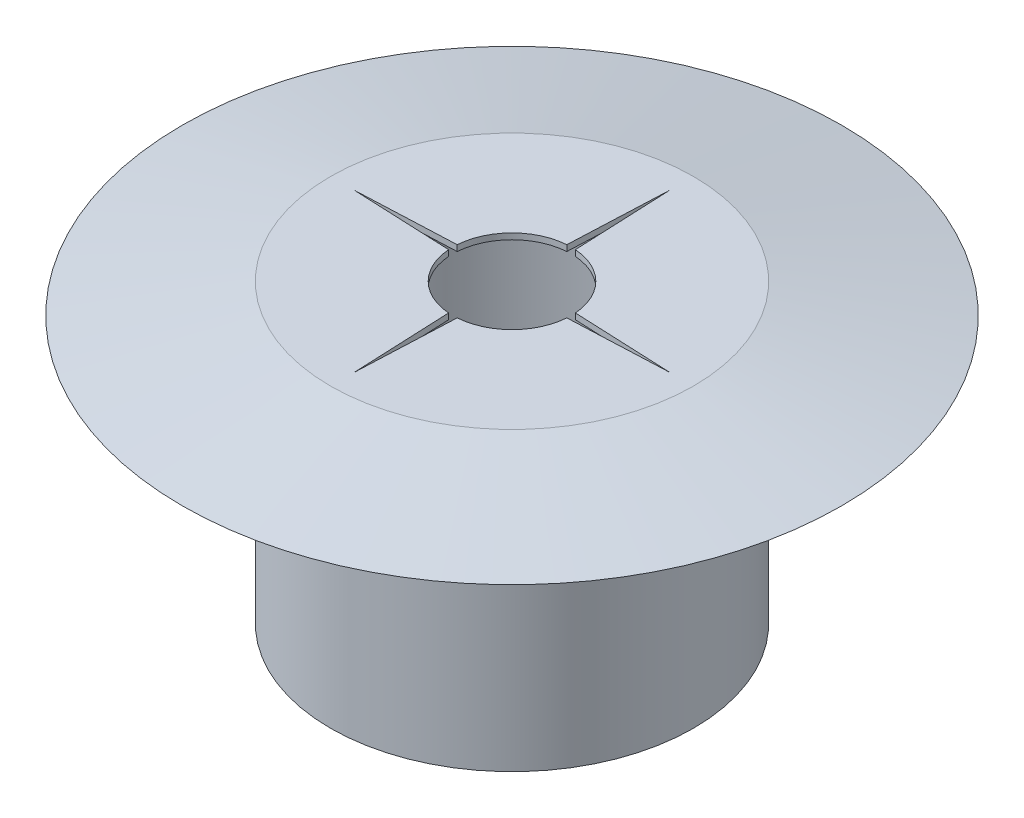
ISO-10303-21;
HEADER;
FILE_DESCRIPTION(('STEP AP214'),'2;1');
FILE_NAME('part.step','',(''),(''),'','','');
FILE_SCHEMA(('AUTOMOTIVE_DESIGN { 1 0 10303 214 1 1 1 1 }'));
ENDSEC;
DATA;
#1=APPLICATION_CONTEXT('core data for automotive mechanical design processes');
#2=APPLICATION_PROTOCOL_DEFINITION('international standard','automotive_design',2000,#1);
#3=PRODUCT_CONTEXT('',#1,'mechanical');
#4=PRODUCT('Part','Part','',(#3));
#5=PRODUCT_RELATED_PRODUCT_CATEGORY('part','',(#4));
#6=PRODUCT_DEFINITION_FORMATION('','',#4);
#7=PRODUCT_DEFINITION_CONTEXT('part definition',#1,'design');
#8=PRODUCT_DEFINITION('design','',#6,#7);
#9=PRODUCT_DEFINITION_SHAPE('','',#8);
#10=(LENGTH_UNIT() NAMED_UNIT(*) SI_UNIT(.MILLI.,.METRE.));
#11=(NAMED_UNIT(*) PLANE_ANGLE_UNIT() SI_UNIT($,.RADIAN.));
#12=(NAMED_UNIT(*) SI_UNIT($,.STERADIAN.) SOLID_ANGLE_UNIT());
#13=UNCERTAINTY_MEASURE_WITH_UNIT(LENGTH_MEASURE(1.E-05),#10,'distance_accuracy_value','');
#14=(GEOMETRIC_REPRESENTATION_CONTEXT(3) GLOBAL_UNCERTAINTY_ASSIGNED_CONTEXT((#13)) GLOBAL_UNIT_ASSIGNED_CONTEXT((#10,
#11,#12)) REPRESENTATION_CONTEXT('',''));
#15=CARTESIAN_POINT('',(0.,0.,0.));
#16=DIRECTION('',(0.,0.,1.));
#17=DIRECTION('',(1.,0.,0.));
#18=AXIS2_PLACEMENT_3D('',#15,#16,#17);
#19=CARTESIAN_POINT('',(0.,0.,0.));
#20=DIRECTION('',(0.,-1.,0.));
#21=DIRECTION('',(0.,0.,-1.));
#22=AXIS2_PLACEMENT_3D('',#19,#20,#21);
#23=CYLINDRICAL_SURFACE('',#22,10.9);
#24=CARTESIAN_POINT('',(0.,0.,0.));
#25=DIRECTION('',(0.,-1.,0.));
#26=DIRECTION('',(0.,0.,-1.));
#27=AXIS2_PLACEMENT_3D('',#24,#25,#26);
#28=CIRCLE('',#27,10.9);
#29=CARTESIAN_POINT('',(0.,0.,-10.9));
#30=VERTEX_POINT('',#29);
#31=EDGE_CURVE('E44',#30,#30,#28,.T.);
#32=ORIENTED_EDGE('',*,*,#31,.T.);
#33=EDGE_LOOP('',(#32));
#34=FACE_BOUND('',#33,.T.);
#35=CARTESIAN_POINT('',(0.,19.6,0.));
#36=DIRECTION('',(0.,1.,0.));
#37=DIRECTION('',(0.,0.,1.));
#38=AXIS2_PLACEMENT_3D('',#35,#36,#37);
#39=CIRCLE('',#38,10.9);
#40=CARTESIAN_POINT('',(0.,19.6,10.9));
#41=VERTEX_POINT('',#40);
#42=EDGE_CURVE('E11',#41,#41,#39,.F.);
#43=ORIENTED_EDGE('',*,*,#42,.F.);
#44=EDGE_LOOP('',(#43));
#45=FACE_BOUND('',#44,.T.);
#46=ADVANCED_FACE('F35',(#34,#45),#23,.F.);
#47=CARTESIAN_POINT('',(-12.25,20.,0.));
#48=DIRECTION('',(0.,-1.,0.));
#49=DIRECTION('',(0.,0.,-1.));
#50=AXIS2_PLACEMENT_3D('',#47,#48,#49);
#51=PLANE('',#50);
#52=CARTESIAN_POINT('',(0.,20.,0.));
#53=DIRECTION('',(0.,-1.,0.));
#54=DIRECTION('',(0.,0.,-1.));
#55=AXIS2_PLACEMENT_3D('',#52,#53,#54);
#56=CIRCLE('',#55,12.25);
#57=CARTESIAN_POINT('',(0.,20.,-12.25));
#58=VERTEX_POINT('',#57);
#59=EDGE_CURVE('E190',#58,#58,#56,.T.);
#60=ORIENTED_EDGE('',*,*,#59,.F.);
#61=EDGE_LOOP('',(#60));
#62=FACE_BOUND('',#61,.T.);
#63=DIRECTION('',(-0.0435759641745513,0.,-0.999050116533829));
#64=VECTOR('',#63,1.);
#65=CARTESIAN_POINT('',(0.463199901978154,20.,-0.0202035733745618));
#66=LINE('',#65,#64);
#67=CARTESIAN_POINT('',(0.290070903590342,20.,-3.98946849478603));
#68=VERTEX_POINT('',#67);
#69=CARTESIAN_POINT('',(0.,20.,-10.6398175008156));
#70=VERTEX_POINT('',#69);
#71=EDGE_CURVE('E157',#68,#70,#66,.T.);
#72=ORIENTED_EDGE('',*,*,#71,.F.);
#73=CARTESIAN_POINT('',(0.,20.,0.));
#74=DIRECTION('',(0.,1.,0.));
#75=DIRECTION('',(0.,0.,1.));
#76=AXIS2_PLACEMENT_3D('',#73,#74,#75);
#77=CIRCLE('',#76,4.);
#78=CARTESIAN_POINT('',(3.98946849478603,20.,-0.290070903590343));
#79=VERTEX_POINT('',#78);
#80=EDGE_CURVE('E159',#68,#79,#77,.F.);
#81=ORIENTED_EDGE('',*,*,#80,.T.);
#82=DIRECTION('',(0.999050116533829,0.,0.0435759641745516));
#83=VECTOR('',#82,1.);
#84=CARTESIAN_POINT('',(0.020203573374562,20.,-0.463199901978156));
#85=LINE('',#84,#83);
#86=CARTESIAN_POINT('',(10.6398175008156,20.,0.));
#87=VERTEX_POINT('',#86);
#88=EDGE_CURVE('E162',#79,#87,#85,.T.);
#89=ORIENTED_EDGE('',*,*,#88,.T.);
#90=DIRECTION('',(0.99905011653383,0.,-0.0435759641745505));
#91=VECTOR('',#90,1.);
#92=CARTESIAN_POINT('',(0.0202035733745613,20.,0.463199901978152));
#93=LINE('',#92,#91);
#94=CARTESIAN_POINT('',(3.98946849478603,20.,0.290070903590343));
#95=VERTEX_POINT('',#94);
#96=EDGE_CURVE('E165',#95,#87,#93,.T.);
#97=ORIENTED_EDGE('',*,*,#96,.F.);
#98=CARTESIAN_POINT('',(0.,20.,0.));
#99=DIRECTION('',(0.,1.,0.));
#100=DIRECTION('',(0.,0.,1.));
#101=AXIS2_PLACEMENT_3D('',#98,#99,#100);
#102=CIRCLE('',#101,4.00000000000002);
#103=CARTESIAN_POINT('',(0.290070903590342,20.,3.98946849478603));
#104=VERTEX_POINT('',#103);
#105=EDGE_CURVE('E168',#95,#104,#102,.F.);
#106=ORIENTED_EDGE('',*,*,#105,.T.);
#107=DIRECTION('',(-0.0435759641745507,0.,0.999050116533829));
#108=VECTOR('',#107,1.);
#109=CARTESIAN_POINT('',(0.463199901978152,20.,0.0202035733745614));
#110=LINE('',#109,#108);
#111=CARTESIAN_POINT('',(0.,20.,10.6398175008156));
#112=VERTEX_POINT('',#111);
#113=EDGE_CURVE('E171',#104,#112,#110,.T.);
#114=ORIENTED_EDGE('',*,*,#113,.T.);
#115=DIRECTION('',(0.0435759641745512,0.,0.999050116533829));
#116=VECTOR('',#115,1.);
#117=CARTESIAN_POINT('',(-0.463199901978154,20.,0.0202035733745617));
#118=LINE('',#117,#116);
#119=CARTESIAN_POINT('',(-0.290070903590342,20.,3.98946849478603));
#120=VERTEX_POINT('',#119);
#121=EDGE_CURVE('E174',#120,#112,#118,.T.);
#122=ORIENTED_EDGE('',*,*,#121,.F.);
#123=CARTESIAN_POINT('',(0.,20.,0.));
#124=DIRECTION('',(0.,1.,0.));
#125=DIRECTION('',(0.,0.,1.));
#126=AXIS2_PLACEMENT_3D('',#123,#124,#125);
#127=CIRCLE('',#126,4.);
#128=CARTESIAN_POINT('',(-3.98946849478603,20.,0.290070903590342));
#129=VERTEX_POINT('',#128);
#130=EDGE_CURVE('E177',#120,#129,#127,.F.);
#131=ORIENTED_EDGE('',*,*,#130,.T.);
#132=DIRECTION('',(-0.99905011653383,0.,-0.0435759641745507));
#133=VECTOR('',#132,1.);
#134=CARTESIAN_POINT('',(-0.0202035733745614,20.,0.463199901978152));
#135=LINE('',#134,#133);
#136=CARTESIAN_POINT('',(-10.6398175008156,20.,0.));
#137=VERTEX_POINT('',#136);
#138=EDGE_CURVE('E180',#129,#137,#135,.T.);
#139=ORIENTED_EDGE('',*,*,#138,.T.);
#140=DIRECTION('',(-0.999050116533829,0.,0.0435759641745513));
#141=VECTOR('',#140,1.);
#142=CARTESIAN_POINT('',(-0.0202035733745618,20.,-0.463199901978154));
#143=LINE('',#142,#141);
#144=CARTESIAN_POINT('',(-3.98946849478603,20.,-0.290070903590342));
#145=VERTEX_POINT('',#144);
#146=EDGE_CURVE('E183',#145,#137,#143,.T.);
#147=ORIENTED_EDGE('',*,*,#146,.F.);
#148=CARTESIAN_POINT('',(0.,20.,0.));
#149=DIRECTION('',(0.,1.,0.));
#150=DIRECTION('',(0.,0.,1.));
#151=AXIS2_PLACEMENT_3D('',#148,#149,#150);
#152=CIRCLE('',#151,3.99999999999997);
#153=CARTESIAN_POINT('',(-0.290070903590342,20.,-3.98946849478603));
#154=VERTEX_POINT('',#153);
#155=EDGE_CURVE('E138',#145,#154,#152,.F.);
#156=ORIENTED_EDGE('',*,*,#155,.T.);
#157=DIRECTION('',(0.0435759641745506,0.,-0.999050116533829));
#158=VECTOR('',#157,1.);
#159=CARTESIAN_POINT('',(-0.463199901978152,20.,-0.0202035733745613));
#160=LINE('',#159,#158);
#161=EDGE_CURVE('E186',#154,#70,#160,.T.);
#162=ORIENTED_EDGE('',*,*,#161,.T.);
#163=EDGE_LOOP('',(#72,#81,#89,#97,#106,#114,#122,#131,#139,#147,#156,#162));
#164=FACE_BOUND('',#163,.T.);
#165=ADVANCED_FACE('F37',(#62,#164),#51,.F.);
#166=CARTESIAN_POINT('',(-10.9,0.,0.));
#167=DIRECTION('',(0.,1.,0.));
#168=DIRECTION('',(0.,0.,1.));
#169=AXIS2_PLACEMENT_3D('',#166,#167,#168);
#170=PLANE('',#169);
#171=ORIENTED_EDGE('',*,*,#31,.F.);
#172=EDGE_LOOP('',(#171));
#173=FACE_BOUND('',#172,.T.);
#174=CARTESIAN_POINT('',(0.,0.,0.));
#175=DIRECTION('',(0.,-1.,0.));
#176=DIRECTION('',(0.,0.,-1.));
#177=AXIS2_PLACEMENT_3D('',#174,#175,#176);
#178=CIRCLE('',#177,12.25);
#179=CARTESIAN_POINT('',(0.,0.,-12.25));
#180=VERTEX_POINT('',#179);
#181=EDGE_CURVE('E216',#180,#180,#178,.T.);
#182=ORIENTED_EDGE('',*,*,#181,.T.);
#183=EDGE_LOOP('',(#182));
#184=FACE_BOUND('',#183,.T.);
#185=ADVANCED_FACE('F223',(#173,#184),#170,.F.);
#186=CARTESIAN_POINT('',(0.,0.,0.));
#187=DIRECTION('',(0.,-1.,0.));
#188=DIRECTION('',(0.,0.,-1.));
#189=AXIS2_PLACEMENT_3D('',#186,#187,#188);
#190=CYLINDRICAL_SURFACE('',#189,12.25);
#191=ORIENTED_EDGE('',*,*,#181,.F.);
#192=EDGE_LOOP('',(#191));
#193=FACE_BOUND('',#192,.T.);
#194=CARTESIAN_POINT('',(0.,18.,0.));
#195=DIRECTION('',(0.,-1.,0.));
#196=DIRECTION('',(0.,0.,-1.));
#197=AXIS2_PLACEMENT_3D('',#194,#195,#196);
#198=CIRCLE('',#197,12.25);
#199=CARTESIAN_POINT('',(0.,18.,-12.25));
#200=VERTEX_POINT('',#199);
#201=EDGE_CURVE('E213',#200,#200,#198,.T.);
#202=ORIENTED_EDGE('',*,*,#201,.T.);
#203=EDGE_LOOP('',(#202));
#204=FACE_BOUND('',#203,.T.);
#205=ADVANCED_FACE('F226',(#193,#204),#190,.T.);
#206=CARTESIAN_POINT('',(-12.25,18.,0.));
#207=DIRECTION('',(0.,1.,0.));
#208=DIRECTION('',(0.,0.,1.));
#209=AXIS2_PLACEMENT_3D('',#206,#207,#208);
#210=PLANE('',#209);
#211=ORIENTED_EDGE('',*,*,#201,.F.);
#212=EDGE_LOOP('',(#211));
#213=FACE_BOUND('',#212,.T.);
#214=CARTESIAN_POINT('',(0.,18.,0.));
#215=DIRECTION('',(0.,-1.,0.));
#216=DIRECTION('',(0.,0.,-1.));
#217=AXIS2_PLACEMENT_3D('',#214,#215,#216);
#218=CIRCLE('',#217,22.25);
#219=CARTESIAN_POINT('',(0.,18.,-22.25));
#220=VERTEX_POINT('',#219);
#221=EDGE_CURVE('E210',#220,#220,#218,.T.);
#222=ORIENTED_EDGE('',*,*,#221,.T.);
#223=EDGE_LOOP('',(#222));
#224=FACE_BOUND('',#223,.T.);
#225=ADVANCED_FACE('F232',(#213,#224),#210,.F.);
#226=CARTESIAN_POINT('',(0.,20.,0.));
#227=DIRECTION('',(0.,-1.,0.));
#228=DIRECTION('',(0.,0.,-1.));
#229=AXIS2_PLACEMENT_3D('',#226,#227,#228);
#230=CONICAL_SURFACE('',#229,12.25,1.37340076694502);
#231=ORIENTED_EDGE('',*,*,#221,.F.);
#232=EDGE_LOOP('',(#231));
#233=FACE_BOUND('',#232,.T.);
#234=ORIENTED_EDGE('',*,*,#59,.T.);
#235=EDGE_LOOP('',(#234));
#236=FACE_BOUND('',#235,.T.);
#237=ADVANCED_FACE('F238',(#233,#236),#230,.T.);
#238=CARTESIAN_POINT('',(0.463199901978154,19.6,-0.0202035733745618));
#239=DIRECTION('',(0.99905011653383,0.,-0.0435759641745513));
#240=DIRECTION('',(-0.0435759641745513,0.,-0.99905011653383));
#241=AXIS2_PLACEMENT_3D('',#238,#239,#240);
#242=PLANE('',#241);
#243=ORIENTED_EDGE('',*,*,#71,.T.);
#244=DIRECTION('',(0.,1.,0.));
#245=VECTOR('',#244,1.);
#246=CARTESIAN_POINT('',(0.,19.6,-10.6398175008156));
#247=LINE('',#246,#245);
#248=CARTESIAN_POINT('',(0.,19.6,-10.6398175008156));
#249=VERTEX_POINT('',#248);
#250=EDGE_CURVE('E100',#249,#70,#247,.T.);
#251=ORIENTED_EDGE('',*,*,#250,.F.);
#252=DIRECTION('',(-0.0435759641745513,0.,-0.999050116533829));
#253=VECTOR('',#252,1.);
#254=CARTESIAN_POINT('',(0.463199901978154,19.6,-0.0202035733745618));
#255=LINE('',#254,#253);
#256=CARTESIAN_POINT('',(0.290070903590342,19.6,-3.98946849478603));
#257=VERTEX_POINT('',#256);
#258=EDGE_CURVE('E52',#257,#249,#255,.T.);
#259=ORIENTED_EDGE('',*,*,#258,.F.);
#260=DIRECTION('',(0.,1.,0.));
#261=VECTOR('',#260,1.);
#262=CARTESIAN_POINT('',(0.290070903590342,19.6,-3.98946849478603));
#263=LINE('',#262,#261);
#264=EDGE_CURVE('E108',#257,#68,#263,.T.);
#265=ORIENTED_EDGE('',*,*,#264,.T.);
#266=EDGE_LOOP('',(#243,#251,#259,#265));
#267=FACE_BOUND('',#266,.T.);
#268=ADVANCED_FACE('F244',(#267),#242,.F.);
#269=CARTESIAN_POINT('',(-0.463199901978152,19.6,-0.0202035733745613));
#270=DIRECTION('',(0.99905011653383,0.,0.0435759641745506));
#271=DIRECTION('',(0.0435759641745506,0.,-0.99905011653383));
#272=AXIS2_PLACEMENT_3D('',#269,#270,#271);
#273=PLANE('',#272);
#274=ORIENTED_EDGE('',*,*,#161,.F.);
#275=DIRECTION('',(0.,1.,0.));
#276=VECTOR('',#275,1.);
#277=CARTESIAN_POINT('',(-0.290070903590342,19.6,-3.98946849478603));
#278=LINE('',#277,#276);
#279=CARTESIAN_POINT('',(-0.290070903590342,19.6,-3.98946849478603));
#280=VERTEX_POINT('',#279);
#281=EDGE_CURVE('E93',#280,#154,#278,.T.);
#282=ORIENTED_EDGE('',*,*,#281,.F.);
#283=DIRECTION('',(0.0435759641745506,0.,-0.999050116533829));
#284=VECTOR('',#283,1.);
#285=CARTESIAN_POINT('',(-0.463199901978152,19.6,-0.0202035733745613));
#286=LINE('',#285,#284);
#287=EDGE_CURVE('E152',#280,#249,#286,.T.);
#288=ORIENTED_EDGE('',*,*,#287,.T.);
#289=ORIENTED_EDGE('',*,*,#250,.T.);
#290=EDGE_LOOP('',(#274,#282,#288,#289));
#291=FACE_BOUND('',#290,.T.);
#292=ADVANCED_FACE('F287',(#291),#273,.T.);
#293=CARTESIAN_POINT('',(0.,19.6,0.));
#294=DIRECTION('',(0.,1.,0.));
#295=DIRECTION('',(0.,0.,1.));
#296=AXIS2_PLACEMENT_3D('',#293,#294,#295);
#297=CYLINDRICAL_SURFACE('',#296,3.99999999999997);
#298=ORIENTED_EDGE('',*,*,#155,.F.);
#299=DIRECTION('',(0.,1.,0.));
#300=VECTOR('',#299,1.);
#301=CARTESIAN_POINT('',(-3.98946849478603,19.6,-0.290070903590342));
#302=LINE('',#301,#300);
#303=CARTESIAN_POINT('',(-3.98946849478603,19.6,-0.290070903590342));
#304=VERTEX_POINT('',#303);
#305=EDGE_CURVE('E133',#304,#145,#302,.T.);
#306=ORIENTED_EDGE('',*,*,#305,.F.);
#307=CARTESIAN_POINT('',(0.,19.6,0.));
#308=DIRECTION('',(0.,1.,0.));
#309=DIRECTION('',(0.,0.,1.));
#310=AXIS2_PLACEMENT_3D('',#307,#308,#309);
#311=CIRCLE('',#310,3.99999999999997);
#312=EDGE_CURVE('E137',#304,#280,#311,.F.);
#313=ORIENTED_EDGE('',*,*,#312,.T.);
#314=ORIENTED_EDGE('',*,*,#281,.T.);
#315=EDGE_LOOP('',(#298,#306,#313,#314));
#316=FACE_BOUND('',#315,.T.);
#317=ADVANCED_FACE('F135',(#316),#297,.F.);
#318=CARTESIAN_POINT('',(-0.0202035733745618,19.6,-0.463199901978154));
#319=DIRECTION('',(-0.0435759641745513,0.,-0.99905011653383));
#320=DIRECTION('',(-0.99905011653383,0.,0.0435759641745513));
#321=AXIS2_PLACEMENT_3D('',#318,#319,#320);
#322=PLANE('',#321);
#323=ORIENTED_EDGE('',*,*,#146,.T.);
#324=DIRECTION('',(0.,1.,0.));
#325=VECTOR('',#324,1.);
#326=CARTESIAN_POINT('',(-10.6398175008156,19.6,0.));
#327=LINE('',#326,#325);
#328=CARTESIAN_POINT('',(-10.6398175008156,19.6,0.));
#329=VERTEX_POINT('',#328);
#330=EDGE_CURVE('E142',#329,#137,#327,.T.);
#331=ORIENTED_EDGE('',*,*,#330,.F.);
#332=DIRECTION('',(-0.999050116533829,0.,0.0435759641745513));
#333=VECTOR('',#332,1.);
#334=CARTESIAN_POINT('',(-0.0202035733745618,19.6,-0.463199901978154));
#335=LINE('',#334,#333);
#336=EDGE_CURVE('E145',#304,#329,#335,.T.);
#337=ORIENTED_EDGE('',*,*,#336,.F.);
#338=ORIENTED_EDGE('',*,*,#305,.T.);
#339=EDGE_LOOP('',(#323,#331,#337,#338));
#340=FACE_BOUND('',#339,.T.);
#341=ADVANCED_FACE('F146',(#340),#322,.F.);
#342=CARTESIAN_POINT('',(-0.0202035733745614,19.6,0.463199901978152));
#343=DIRECTION('',(0.0435759641745506,0.,-0.999050116533829));
#344=DIRECTION('',(-0.99905011653383,0.,-0.0435759641745507));
#345=AXIS2_PLACEMENT_3D('',#342,#343,#344);
#346=PLANE('',#345);
#347=ORIENTED_EDGE('',*,*,#138,.F.);
#348=DIRECTION('',(0.,1.,0.));
#349=VECTOR('',#348,1.);
#350=CARTESIAN_POINT('',(-3.98946849478603,19.6,0.290070903590342));
#351=LINE('',#350,#349);
#352=CARTESIAN_POINT('',(-3.98946849478603,19.6,0.290070903590342));
#353=VERTEX_POINT('',#352);
#354=EDGE_CURVE('E193',#353,#129,#351,.T.);
#355=ORIENTED_EDGE('',*,*,#354,.F.);
#356=DIRECTION('',(-0.99905011653383,0.,-0.0435759641745507));
#357=VECTOR('',#356,1.);
#358=CARTESIAN_POINT('',(-0.0202035733745614,19.6,0.463199901978152));
#359=LINE('',#358,#357);
#360=EDGE_CURVE('E149',#353,#329,#359,.T.);
#361=ORIENTED_EDGE('',*,*,#360,.T.);
#362=ORIENTED_EDGE('',*,*,#330,.T.);
#363=EDGE_LOOP('',(#347,#355,#361,#362));
#364=FACE_BOUND('',#363,.T.);
#365=ADVANCED_FACE('F286',(#364),#346,.T.);
#366=CARTESIAN_POINT('',(0.,19.6,0.));
#367=DIRECTION('',(0.,1.,0.));
#368=DIRECTION('',(0.,0.,1.));
#369=AXIS2_PLACEMENT_3D('',#366,#367,#368);
#370=CYLINDRICAL_SURFACE('',#369,4.);
#371=ORIENTED_EDGE('',*,*,#130,.F.);
#372=DIRECTION('',(0.,1.,0.));
#373=VECTOR('',#372,1.);
#374=CARTESIAN_POINT('',(-0.290070903590342,19.6,3.98946849478603));
#375=LINE('',#374,#373);
#376=CARTESIAN_POINT('',(-0.290070903590342,19.6,3.98946849478603));
#377=VERTEX_POINT('',#376);
#378=EDGE_CURVE('E195',#377,#120,#375,.T.);
#379=ORIENTED_EDGE('',*,*,#378,.F.);
#380=CARTESIAN_POINT('',(0.,19.6,0.));
#381=DIRECTION('',(0.,1.,0.));
#382=DIRECTION('',(0.,0.,1.));
#383=AXIS2_PLACEMENT_3D('',#380,#381,#382);
#384=CIRCLE('',#383,4.);
#385=EDGE_CURVE('E284',#377,#353,#384,.F.);
#386=ORIENTED_EDGE('',*,*,#385,.T.);
#387=ORIENTED_EDGE('',*,*,#354,.T.);
#388=EDGE_LOOP('',(#371,#379,#386,#387));
#389=FACE_BOUND('',#388,.T.);
#390=ADVANCED_FACE('F279',(#389),#370,.F.);
#391=CARTESIAN_POINT('',(-0.463199901978154,19.6,0.0202035733745617));
#392=DIRECTION('',(-0.99905011653383,0.,0.0435759641745512));
#393=DIRECTION('',(0.0435759641745512,0.,0.99905011653383));
#394=AXIS2_PLACEMENT_3D('',#391,#392,#393);
#395=PLANE('',#394);
#396=ORIENTED_EDGE('',*,*,#121,.T.);
#397=DIRECTION('',(0.,1.,0.));
#398=VECTOR('',#397,1.);
#399=CARTESIAN_POINT('',(0.,19.6,10.6398175008156));
#400=LINE('',#399,#398);
#401=CARTESIAN_POINT('',(0.,19.6,10.6398175008156));
#402=VERTEX_POINT('',#401);
#403=EDGE_CURVE('E197',#402,#112,#400,.T.);
#404=ORIENTED_EDGE('',*,*,#403,.F.);
#405=DIRECTION('',(0.0435759641745512,0.,0.999050116533829));
#406=VECTOR('',#405,1.);
#407=CARTESIAN_POINT('',(-0.463199901978154,19.6,0.0202035733745617));
#408=LINE('',#407,#406);
#409=EDGE_CURVE('E436',#377,#402,#408,.T.);
#410=ORIENTED_EDGE('',*,*,#409,.F.);
#411=ORIENTED_EDGE('',*,*,#378,.T.);
#412=EDGE_LOOP('',(#396,#404,#410,#411));
#413=FACE_BOUND('',#412,.T.);
#414=ADVANCED_FACE('F312',(#413),#395,.F.);
#415=CARTESIAN_POINT('',(0.463199901978152,19.6,0.0202035733745614));
#416=DIRECTION('',(-0.99905011653383,0.,-0.0435759641745507));
#417=DIRECTION('',(-0.0435759641745507,0.,0.99905011653383));
#418=AXIS2_PLACEMENT_3D('',#415,#416,#417);
#419=PLANE('',#418);
#420=ORIENTED_EDGE('',*,*,#113,.F.);
#421=DIRECTION('',(0.,1.,0.));
#422=VECTOR('',#421,1.);
#423=CARTESIAN_POINT('',(0.290070903590342,19.6,3.98946849478603));
#424=LINE('',#423,#422);
#425=CARTESIAN_POINT('',(0.290070903590342,19.6,3.98946849478603));
#426=VERTEX_POINT('',#425);
#427=EDGE_CURVE('E199',#426,#104,#424,.T.);
#428=ORIENTED_EDGE('',*,*,#427,.F.);
#429=DIRECTION('',(-0.0435759641745507,0.,0.999050116533829));
#430=VECTOR('',#429,1.);
#431=CARTESIAN_POINT('',(0.463199901978152,19.6,0.0202035733745614));
#432=LINE('',#431,#430);
#433=EDGE_CURVE('E440',#426,#402,#432,.T.);
#434=ORIENTED_EDGE('',*,*,#433,.T.);
#435=ORIENTED_EDGE('',*,*,#403,.T.);
#436=EDGE_LOOP('',(#420,#428,#434,#435));
#437=FACE_BOUND('',#436,.T.);
#438=ADVANCED_FACE('F273',(#437),#419,.T.);
#439=CARTESIAN_POINT('',(0.,19.6,0.));
#440=DIRECTION('',(0.,1.,0.));
#441=DIRECTION('',(0.,0.,1.));
#442=AXIS2_PLACEMENT_3D('',#439,#440,#441);
#443=CYLINDRICAL_SURFACE('',#442,4.00000000000002);
#444=ORIENTED_EDGE('',*,*,#105,.F.);
#445=DIRECTION('',(0.,1.,0.));
#446=VECTOR('',#445,1.);
#447=CARTESIAN_POINT('',(3.98946849478603,19.6,0.290070903590343));
#448=LINE('',#447,#446);
#449=CARTESIAN_POINT('',(3.98946849478603,19.6,0.290070903590343));
#450=VERTEX_POINT('',#449);
#451=EDGE_CURVE('E201',#450,#95,#448,.T.);
#452=ORIENTED_EDGE('',*,*,#451,.F.);
#453=CARTESIAN_POINT('',(0.,19.6,0.));
#454=DIRECTION('',(0.,1.,0.));
#455=DIRECTION('',(0.,0.,1.));
#456=AXIS2_PLACEMENT_3D('',#453,#454,#455);
#457=CIRCLE('',#456,4.00000000000002);
#458=EDGE_CURVE('E269',#450,#426,#457,.F.);
#459=ORIENTED_EDGE('',*,*,#458,.T.);
#460=ORIENTED_EDGE('',*,*,#427,.T.);
#461=EDGE_LOOP('',(#444,#452,#459,#460));
#462=FACE_BOUND('',#461,.T.);
#463=ADVANCED_FACE('F264',(#462),#443,.F.);
#464=CARTESIAN_POINT('',(0.0202035733745613,19.6,0.463199901978152));
#465=DIRECTION('',(0.0435759641745505,0.,0.999050116533829));
#466=DIRECTION('',(0.99905011653383,0.,-0.0435759641745505));
#467=AXIS2_PLACEMENT_3D('',#464,#465,#466);
#468=PLANE('',#467);
#469=ORIENTED_EDGE('',*,*,#96,.T.);
#470=DIRECTION('',(0.,1.,0.));
#471=VECTOR('',#470,1.);
#472=CARTESIAN_POINT('',(10.6398175008156,19.6,0.));
#473=LINE('',#472,#471);
#474=CARTESIAN_POINT('',(10.6398175008156,19.6,0.));
#475=VERTEX_POINT('',#474);
#476=EDGE_CURVE('E203',#475,#87,#473,.T.);
#477=ORIENTED_EDGE('',*,*,#476,.F.);
#478=DIRECTION('',(0.99905011653383,0.,-0.0435759641745505));
#479=VECTOR('',#478,1.);
#480=CARTESIAN_POINT('',(0.0202035733745613,19.6,0.463199901978152));
#481=LINE('',#480,#479);
#482=EDGE_CURVE('E443',#450,#475,#481,.T.);
#483=ORIENTED_EDGE('',*,*,#482,.F.);
#484=ORIENTED_EDGE('',*,*,#451,.T.);
#485=EDGE_LOOP('',(#469,#477,#483,#484));
#486=FACE_BOUND('',#485,.T.);
#487=ADVANCED_FACE('F305',(#486),#468,.F.);
#488=CARTESIAN_POINT('',(0.020203573374562,19.6,-0.463199901978156));
#489=DIRECTION('',(-0.0435759641745516,0.,0.99905011653383));
#490=DIRECTION('',(0.99905011653383,0.,0.0435759641745516));
#491=AXIS2_PLACEMENT_3D('',#488,#489,#490);
#492=PLANE('',#491);
#493=ORIENTED_EDGE('',*,*,#88,.F.);
#494=DIRECTION('',(0.,1.,0.));
#495=VECTOR('',#494,1.);
#496=CARTESIAN_POINT('',(3.98946849478603,19.6,-0.290070903590343));
#497=LINE('',#496,#495);
#498=CARTESIAN_POINT('',(3.98946849478603,19.6,-0.290070903590343));
#499=VERTEX_POINT('',#498);
#500=EDGE_CURVE('E205',#499,#79,#497,.T.);
#501=ORIENTED_EDGE('',*,*,#500,.F.);
#502=DIRECTION('',(0.999050116533829,0.,0.0435759641745516));
#503=VECTOR('',#502,1.);
#504=CARTESIAN_POINT('',(0.020203573374562,19.6,-0.463199901978156));
#505=LINE('',#504,#503);
#506=EDGE_CURVE('E445',#499,#475,#505,.T.);
#507=ORIENTED_EDGE('',*,*,#506,.T.);
#508=ORIENTED_EDGE('',*,*,#476,.T.);
#509=EDGE_LOOP('',(#493,#501,#507,#508));
#510=FACE_BOUND('',#509,.T.);
#511=ADVANCED_FACE('F258',(#510),#492,.T.);
#512=CARTESIAN_POINT('',(0.,19.6,0.));
#513=DIRECTION('',(0.,1.,0.));
#514=DIRECTION('',(0.,0.,1.));
#515=AXIS2_PLACEMENT_3D('',#512,#513,#514);
#516=CYLINDRICAL_SURFACE('',#515,4.);
#517=ORIENTED_EDGE('',*,*,#80,.F.);
#518=ORIENTED_EDGE('',*,*,#264,.F.);
#519=CARTESIAN_POINT('',(0.,19.6,0.));
#520=DIRECTION('',(0.,1.,0.));
#521=DIRECTION('',(0.,0.,1.));
#522=AXIS2_PLACEMENT_3D('',#519,#520,#521);
#523=CIRCLE('',#522,4.);
#524=EDGE_CURVE('E254',#257,#499,#523,.F.);
#525=ORIENTED_EDGE('',*,*,#524,.T.);
#526=ORIENTED_EDGE('',*,*,#500,.T.);
#527=EDGE_LOOP('',(#517,#518,#525,#526));
#528=FACE_BOUND('',#527,.T.);
#529=ADVANCED_FACE('F252',(#528),#516,.F.);
#530=CARTESIAN_POINT('',(0.,19.6,0.));
#531=DIRECTION('',(0.,1.,0.));
#532=DIRECTION('',(0.,0.,1.));
#533=AXIS2_PLACEMENT_3D('',#530,#531,#532);
#534=PLANE('',#533);
#535=ORIENTED_EDGE('',*,*,#42,.T.);
#536=EDGE_LOOP('',(#535));
#537=FACE_BOUND('',#536,.T.);
#538=ORIENTED_EDGE('',*,*,#258,.T.);
#539=ORIENTED_EDGE('',*,*,#287,.F.);
#540=ORIENTED_EDGE('',*,*,#312,.F.);
#541=ORIENTED_EDGE('',*,*,#336,.T.);
#542=ORIENTED_EDGE('',*,*,#360,.F.);
#543=ORIENTED_EDGE('',*,*,#385,.F.);
#544=ORIENTED_EDGE('',*,*,#409,.T.);
#545=ORIENTED_EDGE('',*,*,#433,.F.);
#546=ORIENTED_EDGE('',*,*,#458,.F.);
#547=ORIENTED_EDGE('',*,*,#482,.T.);
#548=ORIENTED_EDGE('',*,*,#506,.F.);
#549=ORIENTED_EDGE('',*,*,#524,.F.);
#550=EDGE_LOOP('',(#538,#539,#540,#541,#542,#543,#544,#545,#546,#547,#548,#549));
#551=FACE_BOUND('',#550,.T.);
#552=ADVANCED_FACE('F151',(#537,#551),#534,.F.);
#553=CLOSED_SHELL('',(#46,#165,#185,#205,#225,#237,#268,#292,#317,#341,#365,#390,#414,#438,#463,
#487,#511,#529,#552));
#554=MANIFOLD_SOLID_BREP('B2',#553);
#555=ADVANCED_BREP_SHAPE_REPRESENTATION('',(#18,#554),#14);
#556=SHAPE_DEFINITION_REPRESENTATION(#9,#555);
ENDSEC;
END-ISO-10303-21;
